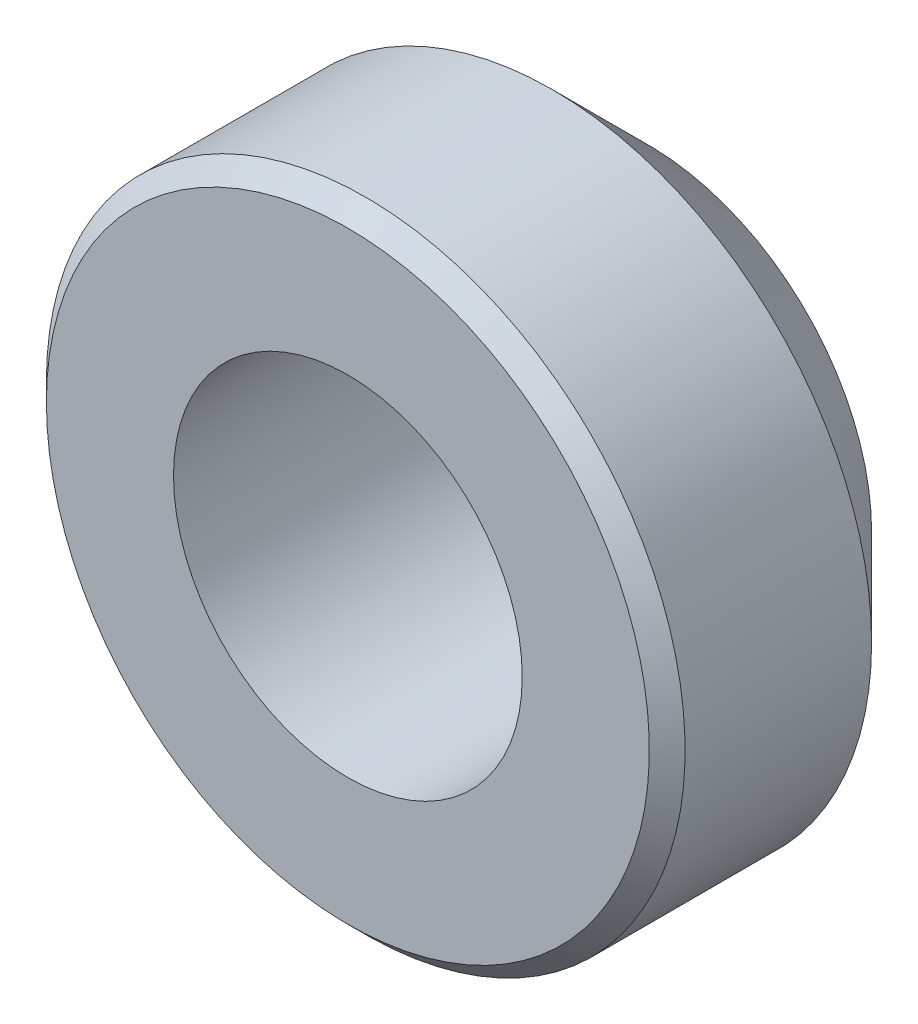
ISO-10303-21;
HEADER;
FILE_DESCRIPTION(('STEP AP214'),'2;1');
FILE_NAME('part.step','',(''),(''),'','','');
FILE_SCHEMA(('AUTOMOTIVE_DESIGN { 1 0 10303 214 1 1 1 1 }'));
ENDSEC;
DATA;
#1=APPLICATION_CONTEXT('core data for automotive mechanical design processes');
#2=APPLICATION_PROTOCOL_DEFINITION('international standard','automotive_design',2000,#1);
#3=PRODUCT_CONTEXT('',#1,'mechanical');
#4=PRODUCT('Part','Part','',(#3));
#5=PRODUCT_RELATED_PRODUCT_CATEGORY('part','',(#4));
#6=PRODUCT_DEFINITION_FORMATION('','',#4);
#7=PRODUCT_DEFINITION_CONTEXT('part definition',#1,'design');
#8=PRODUCT_DEFINITION('design','',#6,#7);
#9=PRODUCT_DEFINITION_SHAPE('','',#8);
#10=(LENGTH_UNIT() NAMED_UNIT(*) SI_UNIT(.MILLI.,.METRE.));
#11=(NAMED_UNIT(*) PLANE_ANGLE_UNIT() SI_UNIT($,.RADIAN.));
#12=(NAMED_UNIT(*) SI_UNIT($,.STERADIAN.) SOLID_ANGLE_UNIT());
#13=UNCERTAINTY_MEASURE_WITH_UNIT(LENGTH_MEASURE(1.E-05),#10,'distance_accuracy_value','');
#14=(GEOMETRIC_REPRESENTATION_CONTEXT(3) GLOBAL_UNCERTAINTY_ASSIGNED_CONTEXT((#13)) GLOBAL_UNIT_ASSIGNED_CONTEXT((#10,
#11,#12)) REPRESENTATION_CONTEXT('',''));
#15=CARTESIAN_POINT('',(0.,0.,0.));
#16=DIRECTION('',(0.,0.,1.));
#17=DIRECTION('',(1.,0.,0.));
#18=AXIS2_PLACEMENT_3D('',#15,#16,#17);
#19=CARTESIAN_POINT('',(0.,0.,-2.0319999999856));
#20=DIRECTION('',(0.,0.,1.));
#21=DIRECTION('',(1.,0.,0.));
#22=AXIS2_PLACEMENT_3D('',#19,#20,#21);
#23=CONICAL_SURFACE('',#22,3.17499999994197,0.785398163397448);
#24=CARTESIAN_POINT('',(0.,0.,-2.98449999996819));
#25=DIRECTION('',(0.,0.,1.));
#26=DIRECTION('',(1.,0.,0.));
#27=AXIS2_PLACEMENT_3D('',#24,#25,#26);
#28=CIRCLE('',#27,2.22249999995938);
#29=CARTESIAN_POINT('',(2.22249999995938,0.,-2.98449999996819));
#30=VERTEX_POINT('',#29);
#31=EDGE_CURVE('E17',#30,#30,#28,.T.);
#32=ORIENTED_EDGE('',*,*,#31,.T.);
#33=EDGE_LOOP('',(#32));
#34=FACE_BOUND('',#33,.T.);
#35=CARTESIAN_POINT('',(0.,0.,-2.032));
#36=DIRECTION('',(0.,0.,-1.));
#37=DIRECTION('',(-1.,0.,0.));
#38=AXIS2_PLACEMENT_3D('',#35,#36,#37);
#39=CIRCLE('',#38,3.175);
#40=CARTESIAN_POINT('',(-3.175,0.,-2.032));
#41=VERTEX_POINT('',#40);
#42=EDGE_CURVE('E29',#41,#41,#39,.F.);
#43=ORIENTED_EDGE('',*,*,#42,.F.);
#44=EDGE_LOOP('',(#43));
#45=FACE_BOUND('',#44,.T.);
#46=ADVANCED_FACE('F14',(#34,#45),#23,.T.);
#47=CARTESIAN_POINT('',(0.,0.,0.));
#48=DIRECTION('',(0.,0.,-1.));
#49=DIRECTION('',(-1.,0.,0.));
#50=AXIS2_PLACEMENT_3D('',#47,#48,#49);
#51=CYLINDRICAL_SURFACE('',#50,3.175);
#52=CARTESIAN_POINT('',(0.,0.,-0.177799999960371));
#53=DIRECTION('',(0.,0.,-1.));
#54=DIRECTION('',(-1.,0.,0.));
#55=AXIS2_PLACEMENT_3D('',#52,#53,#54);
#56=CIRCLE('',#55,3.17499999999882);
#57=CARTESIAN_POINT('',(-3.17499999999882,0.,-0.177799999960371));
#58=VERTEX_POINT('',#57);
#59=EDGE_CURVE('E32',#58,#58,#56,.F.);
#60=ORIENTED_EDGE('',*,*,#59,.F.);
#61=EDGE_LOOP('',(#60));
#62=FACE_BOUND('',#61,.T.);
#63=ORIENTED_EDGE('',*,*,#42,.T.);
#64=EDGE_LOOP('',(#63));
#65=FACE_BOUND('',#64,.T.);
#66=ADVANCED_FACE('F44',(#62,#65),#51,.T.);
#67=CARTESIAN_POINT('',(2.2225,0.,-2.9845));
#68=DIRECTION('',(0.,0.,1.));
#69=DIRECTION('',(1.,0.,0.));
#70=AXIS2_PLACEMENT_3D('',#67,#68,#69);
#71=PLANE('',#70);
#72=ORIENTED_EDGE('',*,*,#31,.F.);
#73=EDGE_LOOP('',(#72));
#74=FACE_BOUND('',#73,.T.);
#75=CARTESIAN_POINT('',(0.,0.,-2.9845));
#76=DIRECTION('',(0.,0.,-1.));
#77=DIRECTION('',(-1.,0.,0.));
#78=AXIS2_PLACEMENT_3D('',#75,#76,#77);
#79=CIRCLE('',#78,1.73355);
#80=CARTESIAN_POINT('',(-1.73355,0.,-2.9845));
#81=VERTEX_POINT('',#80);
#82=EDGE_CURVE('E26',#81,#81,#79,.F.);
#83=ORIENTED_EDGE('',*,*,#82,.T.);
#84=EDGE_LOOP('',(#83));
#85=FACE_BOUND('',#84,.T.);
#86=ADVANCED_FACE('F51',(#74,#85),#71,.F.);
#87=CARTESIAN_POINT('',(0.,0.,-0.177799999960371));
#88=DIRECTION('',(0.,0.,-1.));
#89=DIRECTION('',(-1.,0.,0.));
#90=AXIS2_PLACEMENT_3D('',#87,#88,#89);
#91=CONICAL_SURFACE('',#90,3.17499999999882,0.7853981635573);
#92=CARTESIAN_POINT('',(0.,0.,-5.6843418860808E-11));
#93=DIRECTION('',(0.,0.,-1.));
#94=DIRECTION('',(-1.,0.,0.));
#95=AXIS2_PLACEMENT_3D('',#92,#93,#94);
#96=CIRCLE('',#95,2.99720000003845);
#97=CARTESIAN_POINT('',(-2.99720000003845,0.,-5.6843418860808E-11));
#98=VERTEX_POINT('',#97);
#99=EDGE_CURVE('E21',#98,#98,#96,.T.);
#100=ORIENTED_EDGE('',*,*,#99,.T.);
#101=EDGE_LOOP('',(#100));
#102=FACE_BOUND('',#101,.T.);
#103=ORIENTED_EDGE('',*,*,#59,.T.);
#104=EDGE_LOOP('',(#103));
#105=FACE_BOUND('',#104,.T.);
#106=ADVANCED_FACE('F62',(#102,#105),#91,.T.);
#107=CARTESIAN_POINT('',(0.,0.,0.));
#108=DIRECTION('',(0.,0.,-1.));
#109=DIRECTION('',(-1.,0.,0.));
#110=AXIS2_PLACEMENT_3D('',#107,#108,#109);
#111=CYLINDRICAL_SURFACE('',#110,1.73355);
#112=CARTESIAN_POINT('',(0.,0.,0.));
#113=DIRECTION('',(0.,0.,-1.));
#114=DIRECTION('',(-1.,0.,0.));
#115=AXIS2_PLACEMENT_3D('',#112,#113,#114);
#116=CIRCLE('',#115,1.73355);
#117=CARTESIAN_POINT('',(-1.73355,0.,0.));
#118=VERTEX_POINT('',#117);
#119=EDGE_CURVE('E10',#118,#118,#116,.F.);
#120=ORIENTED_EDGE('',*,*,#119,.T.);
#121=EDGE_LOOP('',(#120));
#122=FACE_BOUND('',#121,.T.);
#123=ORIENTED_EDGE('',*,*,#82,.F.);
#124=EDGE_LOOP('',(#123));
#125=FACE_BOUND('',#124,.T.);
#126=ADVANCED_FACE('F55',(#122,#125),#111,.F.);
#127=CARTESIAN_POINT('',(0.,0.,0.));
#128=DIRECTION('',(0.,0.,-1.));
#129=DIRECTION('',(-1.,0.,0.));
#130=AXIS2_PLACEMENT_3D('',#127,#128,#129);
#131=PLANE('',#130);
#132=ORIENTED_EDGE('',*,*,#119,.F.);
#133=EDGE_LOOP('',(#132));
#134=FACE_BOUND('',#133,.T.);
#135=ORIENTED_EDGE('',*,*,#99,.F.);
#136=EDGE_LOOP('',(#135));
#137=FACE_BOUND('',#136,.T.);
#138=ADVANCED_FACE('F53',(#134,#137),#131,.F.);
#139=CLOSED_SHELL('',(#46,#66,#86,#106,#126,#138));
#140=MANIFOLD_SOLID_BREP('B1',#139);
#141=ADVANCED_BREP_SHAPE_REPRESENTATION('',(#18,#140),#14);
#142=SHAPE_DEFINITION_REPRESENTATION(#9,#141);
ENDSEC;
END-ISO-10303-21;
